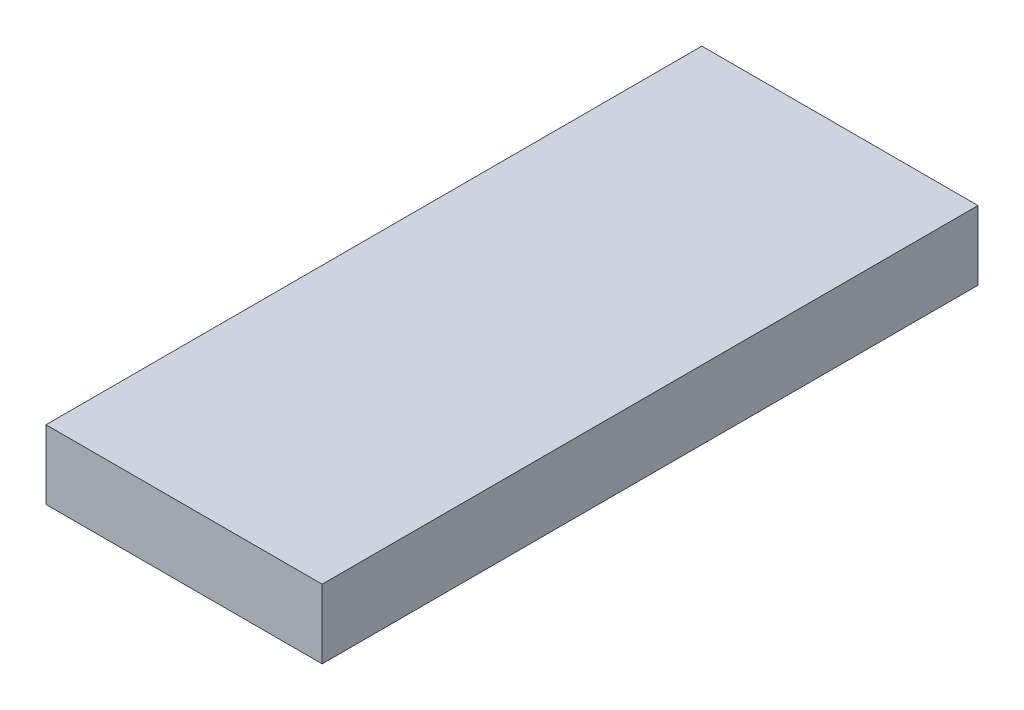
ISO-10303-21;
HEADER;
FILE_DESCRIPTION(('STEP AP214'),'2;1');
FILE_NAME('part.step','',(''),(''),'','','');
FILE_SCHEMA(('AUTOMOTIVE_DESIGN { 1 0 10303 214 1 1 1 1 }'));
ENDSEC;
DATA;
#1=APPLICATION_CONTEXT('core data for automotive mechanical design processes');
#2=APPLICATION_PROTOCOL_DEFINITION('international standard','automotive_design',2000,#1);
#3=PRODUCT_CONTEXT('',#1,'mechanical');
#4=PRODUCT('Part','Part','',(#3));
#5=PRODUCT_RELATED_PRODUCT_CATEGORY('part','',(#4));
#6=PRODUCT_DEFINITION_FORMATION('','',#4);
#7=PRODUCT_DEFINITION_CONTEXT('part definition',#1,'design');
#8=PRODUCT_DEFINITION('design','',#6,#7);
#9=PRODUCT_DEFINITION_SHAPE('','',#8);
#10=(LENGTH_UNIT() NAMED_UNIT(*) SI_UNIT(.MILLI.,.METRE.));
#11=(NAMED_UNIT(*) PLANE_ANGLE_UNIT() SI_UNIT($,.RADIAN.));
#12=(NAMED_UNIT(*) SI_UNIT($,.STERADIAN.) SOLID_ANGLE_UNIT());
#13=UNCERTAINTY_MEASURE_WITH_UNIT(LENGTH_MEASURE(1.E-05),#10,'distance_accuracy_value','');
#14=(GEOMETRIC_REPRESENTATION_CONTEXT(3) GLOBAL_UNCERTAINTY_ASSIGNED_CONTEXT((#13)) GLOBAL_UNIT_ASSIGNED_CONTEXT((#10,
#11,#12)) REPRESENTATION_CONTEXT('',''));
#15=CARTESIAN_POINT('',(0.,0.,0.));
#16=DIRECTION('',(0.,0.,1.));
#17=DIRECTION('',(1.,0.,0.));
#18=AXIS2_PLACEMENT_3D('',#15,#16,#17);
#19=CARTESIAN_POINT('',(-4.,-2.,19.));
#20=DIRECTION('',(1.,0.,0.));
#21=DIRECTION('',(0.,0.,-1.));
#22=AXIS2_PLACEMENT_3D('',#19,#20,#21);
#23=PLANE('',#22);
#24=DIRECTION('',(0.,-1.,0.));
#25=VECTOR('',#24,1.);
#26=CARTESIAN_POINT('',(-4.,-2.,0.));
#27=LINE('',#26,#25);
#28=CARTESIAN_POINT('',(-4.,0.,0.));
#29=VERTEX_POINT('',#28);
#30=CARTESIAN_POINT('',(-4.,-2.,0.));
#31=VERTEX_POINT('',#30);
#32=EDGE_CURVE('E119',#29,#31,#27,.T.);
#33=ORIENTED_EDGE('',*,*,#32,.T.);
#34=DIRECTION('',(0.,0.,-1.));
#35=VECTOR('',#34,1.);
#36=CARTESIAN_POINT('',(-4.,-2.,19.));
#37=LINE('',#36,#35);
#38=CARTESIAN_POINT('',(-4.,-2.,19.));
#39=VERTEX_POINT('',#38);
#40=EDGE_CURVE('E98',#39,#31,#37,.T.);
#41=ORIENTED_EDGE('',*,*,#40,.F.);
#42=DIRECTION('',(0.,-1.,0.));
#43=VECTOR('',#42,1.);
#44=CARTESIAN_POINT('',(-4.,-2.,19.));
#45=LINE('',#44,#43);
#46=CARTESIAN_POINT('',(-4.,0.,19.));
#47=VERTEX_POINT('',#46);
#48=EDGE_CURVE('E107',#47,#39,#45,.T.);
#49=ORIENTED_EDGE('',*,*,#48,.F.);
#50=DIRECTION('',(0.,0.,-1.));
#51=VECTOR('',#50,1.);
#52=CARTESIAN_POINT('',(-4.,0.,19.));
#53=LINE('',#52,#51);
#54=EDGE_CURVE('E153',#47,#29,#53,.T.);
#55=ORIENTED_EDGE('',*,*,#54,.T.);
#56=EDGE_LOOP('',(#33,#41,#49,#55));
#57=FACE_BOUND('',#56,.T.);
#58=ADVANCED_FACE('F41',(#57),#23,.F.);
#59=CARTESIAN_POINT('',(-2.5,-3.5,19.));
#60=DIRECTION('',(0.707106781186547,0.707106781186548,0.));
#61=DIRECTION('',(-0.707106781186548,0.707106781186547,0.));
#62=AXIS2_PLACEMENT_3D('',#59,#60,#61);
#63=PLANE('',#62);
#64=ORIENTED_EDGE('',*,*,#40,.T.);
#65=DIRECTION('',(0.577350269189627,-0.577350269189626,0.577350269189624));
#66=VECTOR('',#65,1.);
#67=CARTESIAN_POINT('',(-0.833333333333328,-5.16666666666667,3.16666666666666));
#68=LINE('',#67,#66);
#69=CARTESIAN_POINT('',(-2.5,-3.5,1.5));
#70=VERTEX_POINT('',#69);
#71=EDGE_CURVE('E50',#31,#70,#68,.T.);
#72=ORIENTED_EDGE('',*,*,#71,.T.);
#73=DIRECTION('',(0.,0.,-1.));
#74=VECTOR('',#73,1.);
#75=CARTESIAN_POINT('',(-2.5,-3.5,19.));
#76=LINE('',#75,#74);
#77=CARTESIAN_POINT('',(-2.5,-3.5,17.5));
#78=VERTEX_POINT('',#77);
#79=EDGE_CURVE('E100',#78,#70,#76,.T.);
#80=ORIENTED_EDGE('',*,*,#79,.F.);
#81=DIRECTION('',(0.577350269189625,-0.577350269189625,-0.577350269189627));
#82=VECTOR('',#81,1.);
#83=CARTESIAN_POINT('',(-2.66666666666667,-3.33333333333333,17.6666666666667));
#84=LINE('',#83,#82);
#85=EDGE_CURVE('E94',#78,#39,#84,.F.);
#86=ORIENTED_EDGE('',*,*,#85,.T.);
#87=EDGE_LOOP('',(#64,#72,#80,#86));
#88=FACE_BOUND('',#87,.T.);
#89=ADVANCED_FACE('F96',(#88),#63,.F.);
#90=CARTESIAN_POINT('',(2.5,-3.5,19.));
#91=DIRECTION('',(0.,1.,0.));
#92=DIRECTION('',(-1.,0.,0.));
#93=AXIS2_PLACEMENT_3D('',#90,#91,#92);
#94=PLANE('',#93);
#95=ORIENTED_EDGE('',*,*,#79,.T.);
#96=DIRECTION('',(1.,0.,0.));
#97=VECTOR('',#96,1.);
#98=CARTESIAN_POINT('',(2.5,-3.5,1.5));
#99=LINE('',#98,#97);
#100=CARTESIAN_POINT('',(2.5,-3.5,1.5));
#101=VERTEX_POINT('',#100);
#102=EDGE_CURVE('E125',#70,#101,#99,.T.);
#103=ORIENTED_EDGE('',*,*,#102,.T.);
#104=DIRECTION('',(0.,0.,-1.));
#105=VECTOR('',#104,1.);
#106=CARTESIAN_POINT('',(2.5,-3.5,19.));
#107=LINE('',#106,#105);
#108=CARTESIAN_POINT('',(2.5,-3.5,17.5));
#109=VERTEX_POINT('',#108);
#110=EDGE_CURVE('E142',#109,#101,#107,.T.);
#111=ORIENTED_EDGE('',*,*,#110,.F.);
#112=DIRECTION('',(-1.,0.,0.));
#113=VECTOR('',#112,1.);
#114=CARTESIAN_POINT('',(2.5,-3.5,17.5));
#115=LINE('',#114,#113);
#116=EDGE_CURVE('E63',#109,#78,#115,.T.);
#117=ORIENTED_EDGE('',*,*,#116,.T.);
#118=EDGE_LOOP('',(#95,#103,#111,#117));
#119=FACE_BOUND('',#118,.T.);
#120=ADVANCED_FACE('F141',(#119),#94,.F.);
#121=CARTESIAN_POINT('',(4.,-2.,19.));
#122=DIRECTION('',(-0.707106781186547,0.707106781186548,0.));
#123=DIRECTION('',(-0.707106781186548,-0.707106781186547,0.));
#124=AXIS2_PLACEMENT_3D('',#121,#122,#123);
#125=PLANE('',#124);
#126=ORIENTED_EDGE('',*,*,#110,.T.);
#127=DIRECTION('',(0.577350269189627,0.577350269189627,-0.577350269189624));
#128=VECTOR('',#127,1.);
#129=CARTESIAN_POINT('',(2.5,-3.5,1.5));
#130=LINE('',#129,#128);
#131=CARTESIAN_POINT('',(4.,-2.,0.));
#132=VERTEX_POINT('',#131);
#133=EDGE_CURVE('E124',#101,#132,#130,.T.);
#134=ORIENTED_EDGE('',*,*,#133,.T.);
#135=DIRECTION('',(0.,0.,-1.));
#136=VECTOR('',#135,1.);
#137=CARTESIAN_POINT('',(4.,-2.,19.));
#138=LINE('',#137,#136);
#139=CARTESIAN_POINT('',(4.,-2.,19.));
#140=VERTEX_POINT('',#139);
#141=EDGE_CURVE('E145',#140,#132,#138,.T.);
#142=ORIENTED_EDGE('',*,*,#141,.F.);
#143=DIRECTION('',(0.577350269189626,0.577350269189625,0.577350269189627));
#144=VECTOR('',#143,1.);
#145=CARTESIAN_POINT('',(2.66666666666667,-3.33333333333333,17.6666666666667));
#146=LINE('',#145,#144);
#147=EDGE_CURVE('E121',#140,#109,#146,.F.);
#148=ORIENTED_EDGE('',*,*,#147,.T.);
#149=EDGE_LOOP('',(#126,#134,#142,#148));
#150=FACE_BOUND('',#149,.T.);
#151=ADVANCED_FACE('F143',(#150),#125,.F.);
#152=CARTESIAN_POINT('',(4.,0.,19.));
#153=DIRECTION('',(-1.,0.,0.));
#154=DIRECTION('',(0.,0.,1.));
#155=AXIS2_PLACEMENT_3D('',#152,#153,#154);
#156=PLANE('',#155);
#157=DIRECTION('',(0.,1.,0.));
#158=VECTOR('',#157,1.);
#159=CARTESIAN_POINT('',(4.,0.,0.));
#160=LINE('',#159,#158);
#161=CARTESIAN_POINT('',(4.,0.,0.));
#162=VERTEX_POINT('',#161);
#163=EDGE_CURVE('E137',#132,#162,#160,.T.);
#164=ORIENTED_EDGE('',*,*,#163,.T.);
#165=DIRECTION('',(0.,0.,-1.));
#166=VECTOR('',#165,1.);
#167=CARTESIAN_POINT('',(4.,0.,19.));
#168=LINE('',#167,#166);
#169=CARTESIAN_POINT('',(4.,0.,19.));
#170=VERTEX_POINT('',#169);
#171=EDGE_CURVE('E148',#170,#162,#168,.T.);
#172=ORIENTED_EDGE('',*,*,#171,.F.);
#173=DIRECTION('',(0.,1.,0.));
#174=VECTOR('',#173,1.);
#175=CARTESIAN_POINT('',(4.,0.,19.));
#176=LINE('',#175,#174);
#177=EDGE_CURVE('E115',#140,#170,#176,.T.);
#178=ORIENTED_EDGE('',*,*,#177,.F.);
#179=ORIENTED_EDGE('',*,*,#141,.T.);
#180=EDGE_LOOP('',(#164,#172,#178,#179));
#181=FACE_BOUND('',#180,.T.);
#182=ADVANCED_FACE('F162',(#181),#156,.F.);
#183=CARTESIAN_POINT('',(-4.,0.,19.));
#184=DIRECTION('',(0.,-1.,0.));
#185=DIRECTION('',(1.,0.,0.));
#186=AXIS2_PLACEMENT_3D('',#183,#184,#185);
#187=PLANE('',#186);
#188=DIRECTION('',(-1.,0.,0.));
#189=VECTOR('',#188,1.);
#190=CARTESIAN_POINT('',(-4.,0.,0.));
#191=LINE('',#190,#189);
#192=EDGE_CURVE('E116',#162,#29,#191,.T.);
#193=ORIENTED_EDGE('',*,*,#192,.T.);
#194=ORIENTED_EDGE('',*,*,#54,.F.);
#195=DIRECTION('',(-1.,0.,0.));
#196=VECTOR('',#195,1.);
#197=CARTESIAN_POINT('',(-4.,0.,19.));
#198=LINE('',#197,#196);
#199=EDGE_CURVE('E111',#170,#47,#198,.T.);
#200=ORIENTED_EDGE('',*,*,#199,.F.);
#201=ORIENTED_EDGE('',*,*,#171,.T.);
#202=EDGE_LOOP('',(#193,#194,#200,#201));
#203=FACE_BOUND('',#202,.T.);
#204=ADVANCED_FACE('F164',(#203),#187,.F.);
#205=CARTESIAN_POINT('',(0.,0.,19.));
#206=DIRECTION('',(0.,0.,-1.));
#207=DIRECTION('',(-1.,0.,0.));
#208=AXIS2_PLACEMENT_3D('',#205,#206,#207);
#209=PLANE('',#208);
#210=ORIENTED_EDGE('',*,*,#48,.T.);
#211=DIRECTION('',(1.,0.,0.));
#212=VECTOR('',#211,1.);
#213=CARTESIAN_POINT('',(0.,-2.,19.));
#214=LINE('',#213,#212);
#215=EDGE_CURVE('E11',#39,#140,#214,.T.);
#216=ORIENTED_EDGE('',*,*,#215,.T.);
#217=ORIENTED_EDGE('',*,*,#177,.T.);
#218=ORIENTED_EDGE('',*,*,#199,.T.);
#219=EDGE_LOOP('',(#210,#216,#217,#218));
#220=FACE_BOUND('',#219,.T.);
#221=ADVANCED_FACE('F108',(#220),#209,.F.);
#222=CARTESIAN_POINT('',(0.,0.,0.));
#223=DIRECTION('',(0.,0.,-1.));
#224=DIRECTION('',(-1.,0.,0.));
#225=AXIS2_PLACEMENT_3D('',#222,#223,#224);
#226=PLANE('',#225);
#227=ORIENTED_EDGE('',*,*,#163,.F.);
#228=DIRECTION('',(-1.,0.,0.));
#229=VECTOR('',#228,1.);
#230=CARTESIAN_POINT('',(-2.5,-2.,0.));
#231=LINE('',#230,#229);
#232=EDGE_CURVE('E103',#132,#31,#231,.T.);
#233=ORIENTED_EDGE('',*,*,#232,.T.);
#234=ORIENTED_EDGE('',*,*,#32,.F.);
#235=ORIENTED_EDGE('',*,*,#192,.F.);
#236=EDGE_LOOP('',(#227,#233,#234,#235));
#237=FACE_BOUND('',#236,.T.);
#238=ADVANCED_FACE('F135',(#237),#226,.T.);
#239=CARTESIAN_POINT('',(2.5,-3.5,1.5));
#240=DIRECTION('',(0.,-0.707106781186546,-0.707106781186549));
#241=DIRECTION('',(-1.,0.,0.));
#242=AXIS2_PLACEMENT_3D('',#239,#240,#241);
#243=PLANE('',#242);
#244=ORIENTED_EDGE('',*,*,#71,.F.);
#245=ORIENTED_EDGE('',*,*,#232,.F.);
#246=ORIENTED_EDGE('',*,*,#133,.F.);
#247=ORIENTED_EDGE('',*,*,#102,.F.);
#248=EDGE_LOOP('',(#244,#245,#246,#247));
#249=FACE_BOUND('',#248,.T.);
#250=ADVANCED_FACE('F139',(#249),#243,.T.);
#251=CARTESIAN_POINT('',(0.,-2.,19.));
#252=DIRECTION('',(0.,0.707106781186548,-0.707106781186547));
#253=DIRECTION('',(1.,0.,0.));
#254=AXIS2_PLACEMENT_3D('',#251,#252,#253);
#255=PLANE('',#254);
#256=ORIENTED_EDGE('',*,*,#85,.F.);
#257=ORIENTED_EDGE('',*,*,#116,.F.);
#258=ORIENTED_EDGE('',*,*,#147,.F.);
#259=ORIENTED_EDGE('',*,*,#215,.F.);
#260=EDGE_LOOP('',(#256,#257,#258,#259));
#261=FACE_BOUND('',#260,.T.);
#262=ADVANCED_FACE('F44',(#261),#255,.F.);
#263=CLOSED_SHELL('',(#58,#89,#120,#151,#182,#204,#221,#238,#250,#262));
#264=MANIFOLD_SOLID_BREP('B2',#263);
#265=ADVANCED_BREP_SHAPE_REPRESENTATION('',(#18,#264),#14);
#266=SHAPE_DEFINITION_REPRESENTATION(#9,#265);
ENDSEC;
END-ISO-10303-21;
